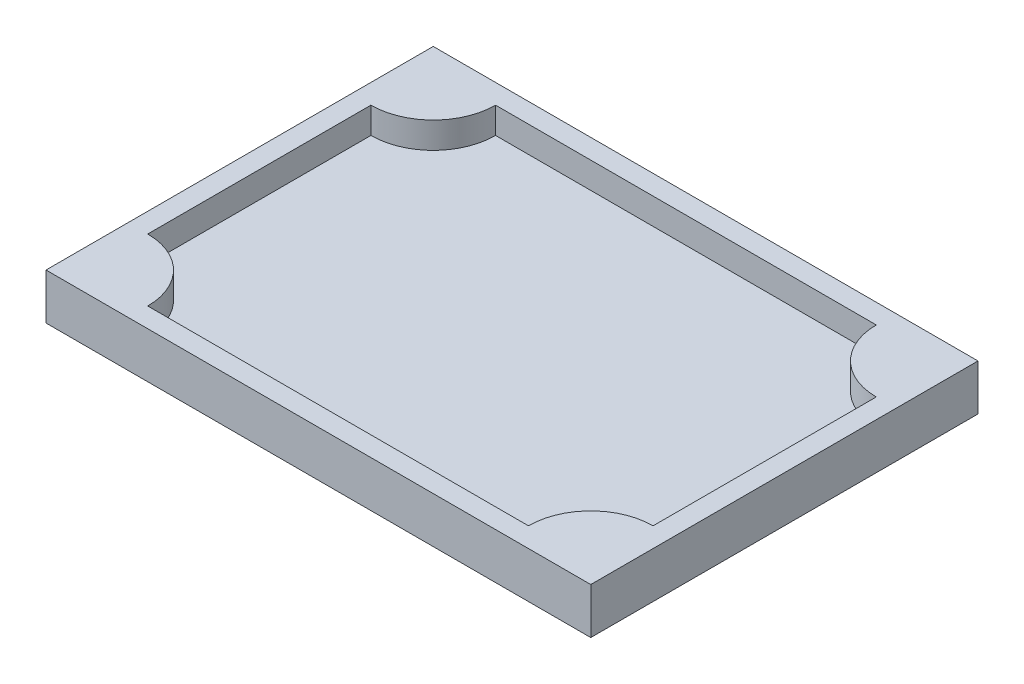
ISO-10303-21;
HEADER;
FILE_DESCRIPTION(('STEP AP214'),'2;1');
FILE_NAME('part.step','',(''),(''),'','','');
FILE_SCHEMA(('AUTOMOTIVE_DESIGN { 1 0 10303 214 1 1 1 1 }'));
ENDSEC;
DATA;
#1=APPLICATION_CONTEXT('core data for automotive mechanical design processes');
#2=APPLICATION_PROTOCOL_DEFINITION('international standard','automotive_design',2000,#1);
#3=PRODUCT_CONTEXT('',#1,'mechanical');
#4=PRODUCT('Part','Part','',(#3));
#5=PRODUCT_RELATED_PRODUCT_CATEGORY('part','',(#4));
#6=PRODUCT_DEFINITION_FORMATION('','',#4);
#7=PRODUCT_DEFINITION_CONTEXT('part definition',#1,'design');
#8=PRODUCT_DEFINITION('design','',#6,#7);
#9=PRODUCT_DEFINITION_SHAPE('','',#8);
#10=(LENGTH_UNIT() NAMED_UNIT(*) SI_UNIT(.MILLI.,.METRE.));
#11=(NAMED_UNIT(*) PLANE_ANGLE_UNIT() SI_UNIT($,.RADIAN.));
#12=(NAMED_UNIT(*) SI_UNIT($,.STERADIAN.) SOLID_ANGLE_UNIT());
#13=UNCERTAINTY_MEASURE_WITH_UNIT(LENGTH_MEASURE(1.E-05),#10,'distance_accuracy_value','');
#14=(GEOMETRIC_REPRESENTATION_CONTEXT(3) GLOBAL_UNCERTAINTY_ASSIGNED_CONTEXT((#13)) GLOBAL_UNIT_ASSIGNED_CONTEXT((#10,
#11,#12)) REPRESENTATION_CONTEXT('',''));
#15=CARTESIAN_POINT('',(0.,0.,0.));
#16=DIRECTION('',(0.,0.,1.));
#17=DIRECTION('',(1.,0.,0.));
#18=AXIS2_PLACEMENT_3D('',#15,#16,#17);
#19=CARTESIAN_POINT('',(0.,3.,0.));
#20=DIRECTION('',(1.,0.,0.));
#21=DIRECTION('',(0.,0.,-1.));
#22=AXIS2_PLACEMENT_3D('',#19,#20,#21);
#23=PLANE('',#22);
#24=DIRECTION('',(0.,0.,1.));
#25=VECTOR('',#24,1.);
#26=CARTESIAN_POINT('',(0.,0.,0.));
#27=LINE('',#26,#25);
#28=CARTESIAN_POINT('',(0.,0.,-59.));
#29=VERTEX_POINT('',#28);
#30=CARTESIAN_POINT('',(0.,0.,0.));
#31=VERTEX_POINT('',#30);
#32=EDGE_CURVE('E159',#29,#31,#27,.T.);
#33=ORIENTED_EDGE('',*,*,#32,.T.);
#34=DIRECTION('',(0.,-1.,0.));
#35=VECTOR('',#34,1.);
#36=CARTESIAN_POINT('',(0.,3.,0.));
#37=LINE('',#36,#35);
#38=CARTESIAN_POINT('',(0.,7.00000000000001,0.));
#39=VERTEX_POINT('',#38);
#40=EDGE_CURVE('E12',#39,#31,#37,.T.);
#41=ORIENTED_EDGE('',*,*,#40,.F.);
#42=DIRECTION('',(0.,0.,-1.));
#43=VECTOR('',#42,1.);
#44=CARTESIAN_POINT('',(0.,7.00000000000001,0.));
#45=LINE('',#44,#43);
#46=CARTESIAN_POINT('',(0.,7.00000000000001,-59.));
#47=VERTEX_POINT('',#46);
#48=EDGE_CURVE('E147',#39,#47,#45,.T.);
#49=ORIENTED_EDGE('',*,*,#48,.T.);
#50=DIRECTION('',(0.,-1.,0.));
#51=VECTOR('',#50,1.);
#52=CARTESIAN_POINT('',(0.,3.,-59.));
#53=LINE('',#52,#51);
#54=EDGE_CURVE('E134',#47,#29,#53,.T.);
#55=ORIENTED_EDGE('',*,*,#54,.T.);
#56=EDGE_LOOP('',(#33,#41,#49,#55));
#57=FACE_BOUND('',#56,.T.);
#58=ADVANCED_FACE('F37',(#57),#23,.F.);
#59=CARTESIAN_POINT('',(0.,3.,0.));
#60=DIRECTION('',(0.,0.,-1.));
#61=DIRECTION('',(-1.,0.,0.));
#62=AXIS2_PLACEMENT_3D('',#59,#60,#61);
#63=PLANE('',#62);
#64=DIRECTION('',(1.,0.,0.));
#65=VECTOR('',#64,1.);
#66=CARTESIAN_POINT('',(0.,0.,0.));
#67=LINE('',#66,#65);
#68=CARTESIAN_POINT('',(83.,0.,0.));
#69=VERTEX_POINT('',#68);
#70=EDGE_CURVE('E172',#31,#69,#67,.T.);
#71=ORIENTED_EDGE('',*,*,#70,.T.);
#72=DIRECTION('',(0.,-1.,0.));
#73=VECTOR('',#72,1.);
#74=CARTESIAN_POINT('',(83.,3.,0.));
#75=LINE('',#74,#73);
#76=CARTESIAN_POINT('',(83.,7.00000000000001,0.));
#77=VERTEX_POINT('',#76);
#78=EDGE_CURVE('E44',#77,#69,#75,.T.);
#79=ORIENTED_EDGE('',*,*,#78,.F.);
#80=DIRECTION('',(-1.,0.,0.));
#81=VECTOR('',#80,1.);
#82=CARTESIAN_POINT('',(83.,7.00000000000001,0.));
#83=LINE('',#82,#81);
#84=EDGE_CURVE('E144',#77,#39,#83,.T.);
#85=ORIENTED_EDGE('',*,*,#84,.T.);
#86=ORIENTED_EDGE('',*,*,#40,.T.);
#87=EDGE_LOOP('',(#71,#79,#85,#86));
#88=FACE_BOUND('',#87,.T.);
#89=ADVANCED_FACE('F181',(#88),#63,.F.);
#90=CARTESIAN_POINT('',(83.,3.,0.));
#91=DIRECTION('',(-1.,0.,0.));
#92=DIRECTION('',(0.,0.,1.));
#93=AXIS2_PLACEMENT_3D('',#90,#91,#92);
#94=PLANE('',#93);
#95=DIRECTION('',(0.,0.,-1.));
#96=VECTOR('',#95,1.);
#97=CARTESIAN_POINT('',(83.,0.,0.));
#98=LINE('',#97,#96);
#99=CARTESIAN_POINT('',(83.,0.,-59.));
#100=VERTEX_POINT('',#99);
#101=EDGE_CURVE('E132',#69,#100,#98,.T.);
#102=ORIENTED_EDGE('',*,*,#101,.T.);
#103=DIRECTION('',(0.,-1.,0.));
#104=VECTOR('',#103,1.);
#105=CARTESIAN_POINT('',(83.,3.,-59.));
#106=LINE('',#105,#104);
#107=CARTESIAN_POINT('',(83.,7.00000000000001,-59.));
#108=VERTEX_POINT('',#107);
#109=EDGE_CURVE('E126',#108,#100,#106,.T.);
#110=ORIENTED_EDGE('',*,*,#109,.F.);
#111=DIRECTION('',(0.,0.,1.));
#112=VECTOR('',#111,1.);
#113=CARTESIAN_POINT('',(83.,7.00000000000001,0.));
#114=LINE('',#113,#112);
#115=EDGE_CURVE('E130',#108,#77,#114,.T.);
#116=ORIENTED_EDGE('',*,*,#115,.T.);
#117=ORIENTED_EDGE('',*,*,#78,.T.);
#118=EDGE_LOOP('',(#102,#110,#116,#117));
#119=FACE_BOUND('',#118,.T.);
#120=ADVANCED_FACE('F128',(#119),#94,.F.);
#121=CARTESIAN_POINT('',(0.,3.,-59.));
#122=DIRECTION('',(0.,0.,1.));
#123=DIRECTION('',(1.,0.,0.));
#124=AXIS2_PLACEMENT_3D('',#121,#122,#123);
#125=PLANE('',#124);
#126=DIRECTION('',(-1.,0.,0.));
#127=VECTOR('',#126,1.);
#128=CARTESIAN_POINT('',(0.,0.,-59.));
#129=LINE('',#128,#127);
#130=EDGE_CURVE('E59',#100,#29,#129,.T.);
#131=ORIENTED_EDGE('',*,*,#130,.T.);
#132=ORIENTED_EDGE('',*,*,#54,.F.);
#133=DIRECTION('',(1.,0.,0.));
#134=VECTOR('',#133,1.);
#135=CARTESIAN_POINT('',(83.,7.00000000000001,-59.));
#136=LINE('',#135,#134);
#137=EDGE_CURVE('E141',#47,#108,#136,.T.);
#138=ORIENTED_EDGE('',*,*,#137,.T.);
#139=ORIENTED_EDGE('',*,*,#109,.T.);
#140=EDGE_LOOP('',(#131,#132,#138,#139));
#141=FACE_BOUND('',#140,.T.);
#142=ADVANCED_FACE('F146',(#141),#125,.F.);
#143=CARTESIAN_POINT('',(0.,0.,0.));
#144=DIRECTION('',(0.,-1.,0.));
#145=DIRECTION('',(0.,0.,-1.));
#146=AXIS2_PLACEMENT_3D('',#143,#144,#145);
#147=PLANE('',#146);
#148=ORIENTED_EDGE('',*,*,#32,.F.);
#149=ORIENTED_EDGE('',*,*,#130,.F.);
#150=ORIENTED_EDGE('',*,*,#101,.F.);
#151=ORIENTED_EDGE('',*,*,#70,.F.);
#152=EDGE_LOOP('',(#148,#149,#150,#151));
#153=FACE_BOUND('',#152,.T.);
#154=ADVANCED_FACE('F179',(#153),#147,.T.);
#155=CARTESIAN_POINT('',(3.00000000000001,115.833196944808,-3.));
#156=DIRECTION('',(0.,-1.,0.));
#157=DIRECTION('',(0.,0.,-1.));
#158=AXIS2_PLACEMENT_3D('',#155,#156,#157);
#159=CYLINDRICAL_SURFACE('',#158,9.49999999999998);
#160=CARTESIAN_POINT('',(3.00000000000001,7.00000000000001,-3.));
#161=DIRECTION('',(0.,-1.,0.));
#162=DIRECTION('',(0.,0.,-1.));
#163=AXIS2_PLACEMENT_3D('',#160,#161,#162);
#164=CIRCLE('',#163,9.49999999999998);
#165=CARTESIAN_POINT('',(12.5,7.00000000000001,-3.));
#166=VERTEX_POINT('',#165);
#167=CARTESIAN_POINT('',(3.00000000000001,7.00000000000001,-12.5));
#168=VERTEX_POINT('',#167);
#169=EDGE_CURVE('E153',#166,#168,#164,.F.);
#170=ORIENTED_EDGE('',*,*,#169,.F.);
#171=DIRECTION('',(0.,-1.,0.));
#172=VECTOR('',#171,1.);
#173=CARTESIAN_POINT('',(12.5,115.833196944808,-3.));
#174=LINE('',#173,#172);
#175=CARTESIAN_POINT('',(12.5,3.,-3.));
#176=VERTEX_POINT('',#175);
#177=EDGE_CURVE('E149',#166,#176,#174,.T.);
#178=ORIENTED_EDGE('',*,*,#177,.T.);
#179=CARTESIAN_POINT('',(3.00000000000001,3.,-3.));
#180=DIRECTION('',(0.,-1.,0.));
#181=DIRECTION('',(0.,0.,-1.));
#182=AXIS2_PLACEMENT_3D('',#179,#180,#181);
#183=CIRCLE('',#182,9.49999999999998);
#184=CARTESIAN_POINT('',(3.00000000000001,3.,-12.5));
#185=VERTEX_POINT('',#184);
#186=EDGE_CURVE('E51',#185,#176,#183,.T.);
#187=ORIENTED_EDGE('',*,*,#186,.F.);
#188=DIRECTION('',(0.,-1.,0.));
#189=VECTOR('',#188,1.);
#190=CARTESIAN_POINT('',(3.00000000000001,115.833196944808,-12.5));
#191=LINE('',#190,#189);
#192=EDGE_CURVE('E156',#168,#185,#191,.T.);
#193=ORIENTED_EDGE('',*,*,#192,.F.);
#194=EDGE_LOOP('',(#170,#178,#187,#193));
#195=FACE_BOUND('',#194,.T.);
#196=ADVANCED_FACE('F228',(#195),#159,.T.);
#197=CARTESIAN_POINT('',(12.5,115.833196944808,-3.));
#198=DIRECTION('',(0.,0.,-1.));
#199=DIRECTION('',(-1.,0.,0.));
#200=AXIS2_PLACEMENT_3D('',#197,#198,#199);
#201=PLANE('',#200);
#202=DIRECTION('',(-1.,0.,0.));
#203=VECTOR('',#202,1.);
#204=CARTESIAN_POINT('',(12.5,7.00000000000001,-3.));
#205=LINE('',#204,#203);
#206=CARTESIAN_POINT('',(70.5,7.00000000000001,-3.));
#207=VERTEX_POINT('',#206);
#208=EDGE_CURVE('E157',#207,#166,#205,.T.);
#209=ORIENTED_EDGE('',*,*,#208,.F.);
#210=DIRECTION('',(0.,-1.,0.));
#211=VECTOR('',#210,1.);
#212=CARTESIAN_POINT('',(70.5,115.833196944808,-3.));
#213=LINE('',#212,#211);
#214=CARTESIAN_POINT('',(70.5,3.,-3.));
#215=VERTEX_POINT('',#214);
#216=EDGE_CURVE('E198',#207,#215,#213,.T.);
#217=ORIENTED_EDGE('',*,*,#216,.T.);
#218=DIRECTION('',(1.,0.,0.));
#219=VECTOR('',#218,1.);
#220=CARTESIAN_POINT('',(12.5,3.,-3.));
#221=LINE('',#220,#219);
#222=EDGE_CURVE('E203',#176,#215,#221,.T.);
#223=ORIENTED_EDGE('',*,*,#222,.F.);
#224=ORIENTED_EDGE('',*,*,#177,.F.);
#225=EDGE_LOOP('',(#209,#217,#223,#224));
#226=FACE_BOUND('',#225,.T.);
#227=ADVANCED_FACE('F234',(#226),#201,.T.);
#228=CARTESIAN_POINT('',(80.,115.833196944808,-3.00000000000001));
#229=DIRECTION('',(0.,-1.,0.));
#230=DIRECTION('',(0.,0.,-1.));
#231=AXIS2_PLACEMENT_3D('',#228,#229,#230);
#232=CYLINDRICAL_SURFACE('',#231,9.49999999999997);
#233=CARTESIAN_POINT('',(80.,7.00000000000001,-3.00000000000001));
#234=DIRECTION('',(0.,-1.,0.));
#235=DIRECTION('',(0.,0.,-1.));
#236=AXIS2_PLACEMENT_3D('',#233,#234,#235);
#237=CIRCLE('',#236,9.49999999999997);
#238=CARTESIAN_POINT('',(80.,7.00000000000001,-12.5));
#239=VERTEX_POINT('',#238);
#240=EDGE_CURVE('E160',#239,#207,#237,.F.);
#241=ORIENTED_EDGE('',*,*,#240,.F.);
#242=DIRECTION('',(0.,-1.,0.));
#243=VECTOR('',#242,1.);
#244=CARTESIAN_POINT('',(80.,115.833196944808,-12.5));
#245=LINE('',#244,#243);
#246=CARTESIAN_POINT('',(80.,3.,-12.5));
#247=VERTEX_POINT('',#246);
#248=EDGE_CURVE('E196',#239,#247,#245,.T.);
#249=ORIENTED_EDGE('',*,*,#248,.T.);
#250=CARTESIAN_POINT('',(80.,3.,-3.00000000000001));
#251=DIRECTION('',(0.,-1.,0.));
#252=DIRECTION('',(0.,0.,1.));
#253=AXIS2_PLACEMENT_3D('',#250,#251,#252);
#254=CIRCLE('',#253,9.49999999999997);
#255=EDGE_CURVE('E207',#215,#247,#254,.T.);
#256=ORIENTED_EDGE('',*,*,#255,.F.);
#257=ORIENTED_EDGE('',*,*,#216,.F.);
#258=EDGE_LOOP('',(#241,#249,#256,#257));
#259=FACE_BOUND('',#258,.T.);
#260=ADVANCED_FACE('F240',(#259),#232,.T.);
#261=CARTESIAN_POINT('',(80.,115.833196944808,-46.5));
#262=DIRECTION('',(-1.,0.,0.));
#263=DIRECTION('',(0.,0.,1.));
#264=AXIS2_PLACEMENT_3D('',#261,#262,#263);
#265=PLANE('',#264);
#266=DIRECTION('',(0.,0.,1.));
#267=VECTOR('',#266,1.);
#268=CARTESIAN_POINT('',(80.,7.00000000000001,-46.5));
#269=LINE('',#268,#267);
#270=CARTESIAN_POINT('',(80.,7.00000000000001,-46.5));
#271=VERTEX_POINT('',#270);
#272=EDGE_CURVE('E162',#271,#239,#269,.T.);
#273=ORIENTED_EDGE('',*,*,#272,.F.);
#274=DIRECTION('',(0.,-1.,0.));
#275=VECTOR('',#274,1.);
#276=CARTESIAN_POINT('',(80.,115.833196944808,-46.5));
#277=LINE('',#276,#275);
#278=CARTESIAN_POINT('',(80.,3.,-46.5));
#279=VERTEX_POINT('',#278);
#280=EDGE_CURVE('E194',#271,#279,#277,.T.);
#281=ORIENTED_EDGE('',*,*,#280,.T.);
#282=DIRECTION('',(0.,0.,-1.));
#283=VECTOR('',#282,1.);
#284=CARTESIAN_POINT('',(80.,3.,-46.5));
#285=LINE('',#284,#283);
#286=EDGE_CURVE('E210',#247,#279,#285,.T.);
#287=ORIENTED_EDGE('',*,*,#286,.F.);
#288=ORIENTED_EDGE('',*,*,#248,.F.);
#289=EDGE_LOOP('',(#273,#281,#287,#288));
#290=FACE_BOUND('',#289,.T.);
#291=ADVANCED_FACE('F244',(#290),#265,.T.);
#292=CARTESIAN_POINT('',(80.,115.833196944808,-56.));
#293=DIRECTION('',(0.,-1.,0.));
#294=DIRECTION('',(0.,0.,-1.));
#295=AXIS2_PLACEMENT_3D('',#292,#293,#294);
#296=CYLINDRICAL_SURFACE('',#295,9.49999999999997);
#297=CARTESIAN_POINT('',(80.,7.00000000000001,-56.));
#298=DIRECTION('',(0.,-1.,0.));
#299=DIRECTION('',(0.,0.,-1.));
#300=AXIS2_PLACEMENT_3D('',#297,#298,#299);
#301=CIRCLE('',#300,9.49999999999997);
#302=CARTESIAN_POINT('',(70.5,7.00000000000001,-56.));
#303=VERTEX_POINT('',#302);
#304=EDGE_CURVE('E164',#303,#271,#301,.F.);
#305=ORIENTED_EDGE('',*,*,#304,.F.);
#306=DIRECTION('',(0.,-1.,0.));
#307=VECTOR('',#306,1.);
#308=CARTESIAN_POINT('',(70.5,115.833196944808,-56.));
#309=LINE('',#308,#307);
#310=CARTESIAN_POINT('',(70.5,3.,-56.));
#311=VERTEX_POINT('',#310);
#312=EDGE_CURVE('E192',#303,#311,#309,.T.);
#313=ORIENTED_EDGE('',*,*,#312,.T.);
#314=CARTESIAN_POINT('',(80.,3.,-56.));
#315=DIRECTION('',(0.,-1.,0.));
#316=DIRECTION('',(0.,0.,-1.));
#317=AXIS2_PLACEMENT_3D('',#314,#315,#316);
#318=CIRCLE('',#317,9.49999999999997);
#319=EDGE_CURVE('E213',#279,#311,#318,.T.);
#320=ORIENTED_EDGE('',*,*,#319,.F.);
#321=ORIENTED_EDGE('',*,*,#280,.F.);
#322=EDGE_LOOP('',(#305,#313,#320,#321));
#323=FACE_BOUND('',#322,.T.);
#324=ADVANCED_FACE('F249',(#323),#296,.T.);
#325=CARTESIAN_POINT('',(12.5,115.833196944808,-56.));
#326=DIRECTION('',(0.,0.,1.));
#327=DIRECTION('',(1.,0.,0.));
#328=AXIS2_PLACEMENT_3D('',#325,#326,#327);
#329=PLANE('',#328);
#330=DIRECTION('',(1.,0.,0.));
#331=VECTOR('',#330,1.);
#332=CARTESIAN_POINT('',(12.5,7.00000000000001,-56.));
#333=LINE('',#332,#331);
#334=CARTESIAN_POINT('',(12.5,7.00000000000001,-56.));
#335=VERTEX_POINT('',#334);
#336=EDGE_CURVE('E166',#335,#303,#333,.T.);
#337=ORIENTED_EDGE('',*,*,#336,.F.);
#338=DIRECTION('',(0.,-1.,0.));
#339=VECTOR('',#338,1.);
#340=CARTESIAN_POINT('',(12.5,115.833196944808,-56.));
#341=LINE('',#340,#339);
#342=CARTESIAN_POINT('',(12.5,3.,-56.));
#343=VERTEX_POINT('',#342);
#344=EDGE_CURVE('E190',#335,#343,#341,.T.);
#345=ORIENTED_EDGE('',*,*,#344,.T.);
#346=DIRECTION('',(-1.,0.,0.));
#347=VECTOR('',#346,1.);
#348=CARTESIAN_POINT('',(12.5,3.,-56.));
#349=LINE('',#348,#347);
#350=EDGE_CURVE('E184',#311,#343,#349,.T.);
#351=ORIENTED_EDGE('',*,*,#350,.F.);
#352=ORIENTED_EDGE('',*,*,#312,.F.);
#353=EDGE_LOOP('',(#337,#345,#351,#352));
#354=FACE_BOUND('',#353,.T.);
#355=ADVANCED_FACE('F254',(#354),#329,.T.);
#356=CARTESIAN_POINT('',(3.00000000000001,115.833196944808,-56.));
#357=DIRECTION('',(0.,-1.,0.));
#358=DIRECTION('',(0.,0.,-1.));
#359=AXIS2_PLACEMENT_3D('',#356,#357,#358);
#360=CYLINDRICAL_SURFACE('',#359,9.49999999999998);
#361=CARTESIAN_POINT('',(3.00000000000001,7.00000000000001,-56.));
#362=DIRECTION('',(0.,-1.,0.));
#363=DIRECTION('',(0.,0.,-1.));
#364=AXIS2_PLACEMENT_3D('',#361,#362,#363);
#365=CIRCLE('',#364,9.49999999999998);
#366=CARTESIAN_POINT('',(3.00000000000001,7.00000000000001,-46.5));
#367=VERTEX_POINT('',#366);
#368=EDGE_CURVE('E168',#367,#335,#365,.F.);
#369=ORIENTED_EDGE('',*,*,#368,.F.);
#370=DIRECTION('',(0.,-1.,0.));
#371=VECTOR('',#370,1.);
#372=CARTESIAN_POINT('',(3.00000000000001,115.833196944808,-46.5));
#373=LINE('',#372,#371);
#374=CARTESIAN_POINT('',(3.00000000000001,3.,-46.5));
#375=VERTEX_POINT('',#374);
#376=EDGE_CURVE('E188',#367,#375,#373,.T.);
#377=ORIENTED_EDGE('',*,*,#376,.T.);
#378=CARTESIAN_POINT('',(3.00000000000001,3.,-56.));
#379=DIRECTION('',(0.,-1.,0.));
#380=DIRECTION('',(0.,0.,1.));
#381=AXIS2_PLACEMENT_3D('',#378,#379,#380);
#382=CIRCLE('',#381,9.49999999999998);
#383=EDGE_CURVE('E182',#343,#375,#382,.T.);
#384=ORIENTED_EDGE('',*,*,#383,.F.);
#385=ORIENTED_EDGE('',*,*,#344,.F.);
#386=EDGE_LOOP('',(#369,#377,#384,#385));
#387=FACE_BOUND('',#386,.T.);
#388=ADVANCED_FACE('F258',(#387),#360,.T.);
#389=CARTESIAN_POINT('',(3.00000000000001,115.833196944808,-46.5));
#390=DIRECTION('',(1.,0.,0.));
#391=DIRECTION('',(0.,0.,-1.));
#392=AXIS2_PLACEMENT_3D('',#389,#390,#391);
#393=PLANE('',#392);
#394=DIRECTION('',(0.,0.,-1.));
#395=VECTOR('',#394,1.);
#396=CARTESIAN_POINT('',(3.00000000000001,7.00000000000001,-46.5));
#397=LINE('',#396,#395);
#398=EDGE_CURVE('E155',#168,#367,#397,.T.);
#399=ORIENTED_EDGE('',*,*,#398,.F.);
#400=ORIENTED_EDGE('',*,*,#192,.T.);
#401=DIRECTION('',(0.,0.,1.));
#402=VECTOR('',#401,1.);
#403=CARTESIAN_POINT('',(3.00000000000001,3.,-46.5));
#404=LINE('',#403,#402);
#405=EDGE_CURVE('E204',#375,#185,#404,.T.);
#406=ORIENTED_EDGE('',*,*,#405,.F.);
#407=ORIENTED_EDGE('',*,*,#376,.F.);
#408=EDGE_LOOP('',(#399,#400,#406,#407));
#409=FACE_BOUND('',#408,.T.);
#410=ADVANCED_FACE('F226',(#409),#393,.T.);
#411=CARTESIAN_POINT('',(0.,7.,0.));
#412=DIRECTION('',(0.,-1.,0.));
#413=DIRECTION('',(0.,0.,-1.));
#414=AXIS2_PLACEMENT_3D('',#411,#412,#413);
#415=PLANE('',#414);
#416=ORIENTED_EDGE('',*,*,#169,.T.);
#417=ORIENTED_EDGE('',*,*,#398,.T.);
#418=ORIENTED_EDGE('',*,*,#368,.T.);
#419=ORIENTED_EDGE('',*,*,#336,.T.);
#420=ORIENTED_EDGE('',*,*,#304,.T.);
#421=ORIENTED_EDGE('',*,*,#272,.T.);
#422=ORIENTED_EDGE('',*,*,#240,.T.);
#423=ORIENTED_EDGE('',*,*,#208,.T.);
#424=EDGE_LOOP('',(#416,#417,#418,#419,#420,#421,#422,#423));
#425=FACE_BOUND('',#424,.T.);
#426=ORIENTED_EDGE('',*,*,#115,.F.);
#427=ORIENTED_EDGE('',*,*,#137,.F.);
#428=ORIENTED_EDGE('',*,*,#48,.F.);
#429=ORIENTED_EDGE('',*,*,#84,.F.);
#430=EDGE_LOOP('',(#426,#427,#428,#429));
#431=FACE_BOUND('',#430,.T.);
#432=ADVANCED_FACE('F139',(#425,#431),#415,.F.);
#433=CARTESIAN_POINT('',(0.,3.,0.));
#434=DIRECTION('',(0.,-1.,0.));
#435=DIRECTION('',(0.,0.,-1.));
#436=AXIS2_PLACEMENT_3D('',#433,#434,#435);
#437=PLANE('',#436);
#438=ORIENTED_EDGE('',*,*,#405,.T.);
#439=ORIENTED_EDGE('',*,*,#186,.T.);
#440=ORIENTED_EDGE('',*,*,#222,.T.);
#441=ORIENTED_EDGE('',*,*,#255,.T.);
#442=ORIENTED_EDGE('',*,*,#286,.T.);
#443=ORIENTED_EDGE('',*,*,#319,.T.);
#444=ORIENTED_EDGE('',*,*,#350,.T.);
#445=ORIENTED_EDGE('',*,*,#383,.T.);
#446=EDGE_LOOP('',(#438,#439,#440,#441,#442,#443,#444,#445));
#447=FACE_BOUND('',#446,.T.);
#448=ADVANCED_FACE('F221',(#447),#437,.F.);
#449=CLOSED_SHELL('',(#58,#89,#120,#142,#154,#196,#227,#260,#291,#324,#355,#388,#410,#432,#448));
#450=MANIFOLD_SOLID_BREP('B2',#449);
#451=ADVANCED_BREP_SHAPE_REPRESENTATION('',(#18,#450),#14);
#452=SHAPE_DEFINITION_REPRESENTATION(#9,#451);
ENDSEC;
END-ISO-10303-21;
